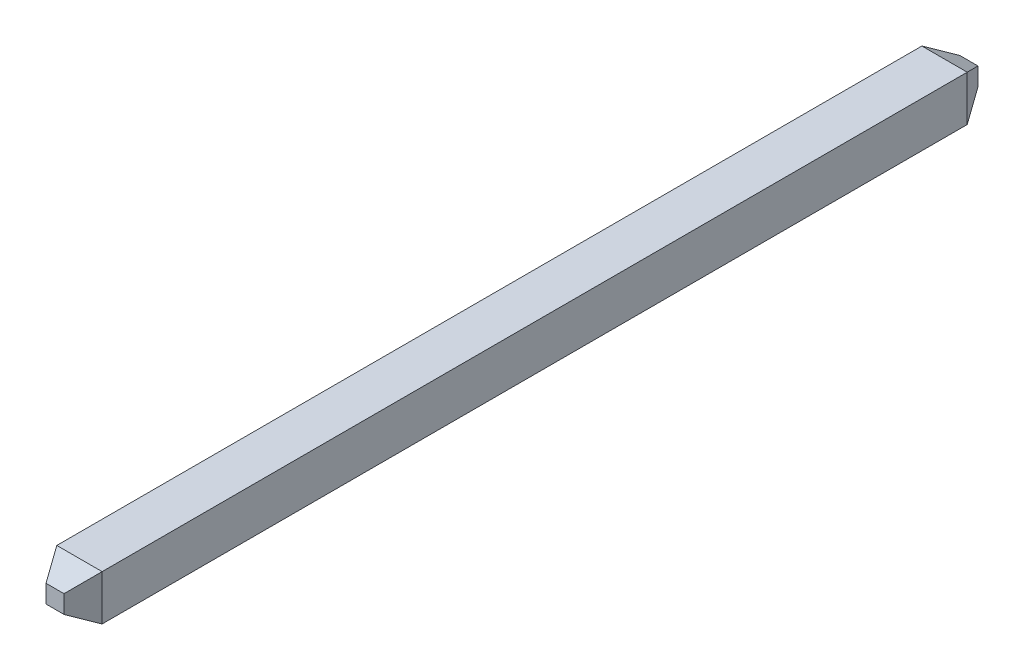
ISO-10303-21;
HEADER;
FILE_DESCRIPTION(('STEP AP214'),'2;1');
FILE_NAME('part.step','',(''),(''),'','','');
FILE_SCHEMA(('AUTOMOTIVE_DESIGN { 1 0 10303 214 1 1 1 1 }'));
ENDSEC;
DATA;
#1=APPLICATION_CONTEXT('core data for automotive mechanical design processes');
#2=APPLICATION_PROTOCOL_DEFINITION('international standard','automotive_design',2000,#1);
#3=PRODUCT_CONTEXT('',#1,'mechanical');
#4=PRODUCT('Part','Part','',(#3));
#5=PRODUCT_RELATED_PRODUCT_CATEGORY('part','',(#4));
#6=PRODUCT_DEFINITION_FORMATION('','',#4);
#7=PRODUCT_DEFINITION_CONTEXT('part definition',#1,'design');
#8=PRODUCT_DEFINITION('design','',#6,#7);
#9=PRODUCT_DEFINITION_SHAPE('','',#8);
#10=(LENGTH_UNIT() NAMED_UNIT(*) SI_UNIT(.MILLI.,.METRE.));
#11=(NAMED_UNIT(*) PLANE_ANGLE_UNIT() SI_UNIT($,.RADIAN.));
#12=(NAMED_UNIT(*) SI_UNIT($,.STERADIAN.) SOLID_ANGLE_UNIT());
#13=UNCERTAINTY_MEASURE_WITH_UNIT(LENGTH_MEASURE(1.E-05),#10,'distance_accuracy_value','');
#14=(GEOMETRIC_REPRESENTATION_CONTEXT(3) GLOBAL_UNCERTAINTY_ASSIGNED_CONTEXT((#13)) GLOBAL_UNIT_ASSIGNED_CONTEXT((#10,
#11,#12)) REPRESENTATION_CONTEXT('',''));
#15=CARTESIAN_POINT('',(0.,0.,0.));
#16=DIRECTION('',(0.,0.,1.));
#17=DIRECTION('',(1.,0.,0.));
#18=AXIS2_PLACEMENT_3D('',#15,#16,#17);
#19=CARTESIAN_POINT('',(5.20011510041924,-1.595,-3.20872569516347));
#20=DIRECTION('',(0.872569516347453,0.,-0.488489958076081));
#21=DIRECTION('',(-0.488489958076081,0.,-0.872569516347453));
#22=AXIS2_PLACEMENT_3D('',#19,#20,#21);
#23=PLANE('',#22);
#24=DIRECTION('',(0.,1.,0.));
#25=VECTOR('',#24,1.);
#26=CARTESIAN_POINT('',(5.39534185664468,-1.595,-2.86000017186176));
#27=LINE('',#26,#25);
#28=CARTESIAN_POINT('',(5.39534185663263,-1.58500002468493,-2.85999984563027));
#29=VERTEX_POINT('',#28);
#30=CARTESIAN_POINT('',(5.39534201729187,-0.954999839641339,-2.8599998849043));
#31=VERTEX_POINT('',#30);
#32=EDGE_CURVE('E118',#29,#31,#27,.T.);
#33=ORIENTED_EDGE('',*,*,#32,.F.);
#34=DIRECTION('',(0.43907261756865,-0.438284036988111,0.784297353956278));
#35=VECTOR('',#34,1.);
#36=CARTESIAN_POINT('',(5.205,-1.395,-3.2));
#37=LINE('',#36,#35);
#38=CARTESIAN_POINT('',(5.205,-1.395,-3.2));
#39=VERTEX_POINT('',#38);
#40=EDGE_CURVE('E116',#39,#29,#37,.T.);
#41=ORIENTED_EDGE('',*,*,#40,.F.);
#42=DIRECTION('',(0.,1.,0.));
#43=VECTOR('',#42,1.);
#44=CARTESIAN_POINT('',(5.205,-1.405,-3.2));
#45=LINE('',#44,#43);
#46=CARTESIAN_POINT('',(5.205,-1.145,-3.2));
#47=VERTEX_POINT('',#46);
#48=EDGE_CURVE('E79',#47,#39,#45,.F.);
#49=ORIENTED_EDGE('',*,*,#48,.F.);
#50=DIRECTION('',(-0.439072617568649,-0.43828403698811,-0.784297353956278));
#51=VECTOR('',#50,1.);
#52=CARTESIAN_POINT('',(5.39534185664468,-0.955000000000001,-2.86000017186176));
#53=LINE('',#52,#51);
#54=EDGE_CURVE('E110',#31,#47,#53,.T.);
#55=ORIENTED_EDGE('',*,*,#54,.F.);
#56=EDGE_LOOP('',(#33,#41,#49,#55));
#57=FACE_BOUND('',#56,.T.);
#58=ADVANCED_FACE('F17',(#57),#23,.T.);
#59=CARTESIAN_POINT('',(5.20036702814295,-1.595,9.50441734607014));
#60=DIRECTION('',(0.873317045523297,0.,0.487152273933377));
#61=DIRECTION('',(0.487152273933377,0.,-0.873317045523297));
#62=AXIS2_PLACEMENT_3D('',#59,#60,#61);
#63=PLANE('',#62);
#64=DIRECTION('',(-0.437799852400894,0.438586917260846,0.784839349959839));
#65=VECTOR('',#64,1.);
#66=CARTESIAN_POINT('',(5.39489789955164,-1.58500031317147,9.15568378706484));
#67=LINE('',#66,#65);
#68=CARTESIAN_POINT('',(5.39489765454992,-1.58500010892315,9.15568368845103));
#69=VERTEX_POINT('',#68);
#70=CARTESIAN_POINT('',(5.20523855088228,-1.395,9.49568417561491));
#71=VERTEX_POINT('',#70);
#72=EDGE_CURVE('E122',#69,#71,#67,.T.);
#73=ORIENTED_EDGE('',*,*,#72,.F.);
#74=DIRECTION('',(0.,1.,0.));
#75=VECTOR('',#74,1.);
#76=CARTESIAN_POINT('',(5.39489853900642,-1.595,9.155683722437));
#77=LINE('',#76,#75);
#78=CARTESIAN_POINT('',(5.39489765280461,-0.954999822967399,9.15568371270386));
#79=VERTEX_POINT('',#78);
#80=EDGE_CURVE('E89',#79,#69,#77,.F.);
#81=ORIENTED_EDGE('',*,*,#80,.F.);
#82=DIRECTION('',(0.437799852400902,0.438586917260844,-0.784839349959836));
#83=VECTOR('',#82,1.);
#84=CARTESIAN_POINT('',(5.20523855088228,-1.145,9.49568417561491));
#85=LINE('',#84,#83);
#86=CARTESIAN_POINT('',(5.20523855088228,-1.145,9.49568417561491));
#87=VERTEX_POINT('',#86);
#88=EDGE_CURVE('E84',#87,#79,#85,.T.);
#89=ORIENTED_EDGE('',*,*,#88,.F.);
#90=DIRECTION('',(0.,1.,0.));
#91=VECTOR('',#90,1.);
#92=CARTESIAN_POINT('',(5.20523855088228,-1.135,9.49568417561491));
#93=LINE('',#92,#91);
#94=EDGE_CURVE('E20',#71,#87,#93,.T.);
#95=ORIENTED_EDGE('',*,*,#94,.F.);
#96=EDGE_LOOP('',(#73,#81,#89,#95));
#97=FACE_BOUND('',#96,.T.);
#98=ADVANCED_FACE('F86',(#97),#63,.T.);
#99=CARTESIAN_POINT('',(4.94523855088228,-1.135,9.49568417561491));
#100=DIRECTION('',(0.,0.,1.));
#101=DIRECTION('',(1.,0.,0.));
#102=AXIS2_PLACEMENT_3D('',#99,#100,#101);
#103=PLANE('',#102);
#104=DIRECTION('',(1.,0.,0.));
#105=VECTOR('',#104,1.);
#106=CARTESIAN_POINT('',(4.7548966942376,-1.145,9.49568417561491));
#107=LINE('',#106,#105);
#108=CARTESIAN_POINT('',(4.95523855088228,-1.145,9.49568417561491));
#109=VERTEX_POINT('',#108);
#110=EDGE_CURVE('E93',#109,#87,#107,.T.);
#111=ORIENTED_EDGE('',*,*,#110,.F.);
#112=DIRECTION('',(0.,1.,0.));
#113=VECTOR('',#112,1.);
#114=CARTESIAN_POINT('',(4.95523855088228,-1.595,9.49568417561491));
#115=LINE('',#114,#113);
#116=CARTESIAN_POINT('',(4.95523855088228,-1.395,9.49568417561491));
#117=VERTEX_POINT('',#116);
#118=EDGE_CURVE('E129',#117,#109,#115,.T.);
#119=ORIENTED_EDGE('',*,*,#118,.F.);
#120=DIRECTION('',(1.,0.,0.));
#121=VECTOR('',#120,1.);
#122=CARTESIAN_POINT('',(4.7548966942376,-1.395,9.49568417561491));
#123=LINE('',#122,#121);
#124=EDGE_CURVE('E98',#71,#117,#123,.F.);
#125=ORIENTED_EDGE('',*,*,#124,.F.);
#126=ORIENTED_EDGE('',*,*,#94,.T.);
#127=EDGE_LOOP('',(#111,#119,#125,#126));
#128=FACE_BOUND('',#127,.T.);
#129=ADVANCED_FACE('F95',(#128),#103,.T.);
#130=CARTESIAN_POINT('',(4.7548966942376,-1.14987821545568,9.50441360938624));
#131=DIRECTION('',(0.,0.872943377132664,0.487821545567864));
#132=DIRECTION('',(0.,-0.487821545567864,0.872943377132664));
#133=AXIS2_PLACEMENT_3D('',#130,#131,#132);
#134=PLANE('',#133);
#135=DIRECTION('',(-0.439072459537934,0.438284700441648,-0.784297071672516));
#136=VECTOR('',#135,1.);
#137=CARTESIAN_POINT('',(4.95523855088228,-1.145,9.49568417561491));
#138=LINE('',#137,#136);
#139=CARTESIAN_POINT('',(4.7648975037028,-0.954999917527427,9.15568447138296));
#140=VERTEX_POINT('',#139);
#141=EDGE_CURVE('E102',#109,#140,#138,.T.);
#142=ORIENTED_EDGE('',*,*,#141,.F.);
#143=ORIENTED_EDGE('',*,*,#110,.T.);
#144=ORIENTED_EDGE('',*,*,#88,.T.);
#145=DIRECTION('',(1.,0.,0.));
#146=VECTOR('',#145,1.);
#147=CARTESIAN_POINT('',(5.08006658937282,-0.955,9.15568497320463));
#148=LINE('',#147,#146);
#149=EDGE_CURVE('E131',#140,#79,#148,.T.);
#150=ORIENTED_EDGE('',*,*,#149,.F.);
#151=EDGE_LOOP('',(#142,#143,#144,#150));
#152=FACE_BOUND('',#151,.T.);
#153=ADVANCED_FACE('F100',(#152),#134,.T.);
#154=CARTESIAN_POINT('',(4.945,-1.405,-3.2));
#155=DIRECTION('',(0.,0.,-1.));
#156=DIRECTION('',(-1.,0.,0.));
#157=AXIS2_PLACEMENT_3D('',#154,#155,#156);
#158=PLANE('',#157);
#159=ORIENTED_EDGE('',*,*,#48,.T.);
#160=DIRECTION('',(1.,0.,0.));
#161=VECTOR('',#160,1.);
#162=CARTESIAN_POINT('',(4.75534185664468,-1.395,-3.2));
#163=LINE('',#162,#161);
#164=CARTESIAN_POINT('',(4.955,-1.395,-3.2));
#165=VERTEX_POINT('',#164);
#166=EDGE_CURVE('E113',#165,#39,#163,.T.);
#167=ORIENTED_EDGE('',*,*,#166,.F.);
#168=DIRECTION('',(0.,1.,0.));
#169=VECTOR('',#168,1.);
#170=CARTESIAN_POINT('',(4.955,-1.595,-3.2));
#171=LINE('',#170,#169);
#172=CARTESIAN_POINT('',(4.955,-1.145,-3.2));
#173=VERTEX_POINT('',#172);
#174=EDGE_CURVE('E140',#173,#165,#171,.F.);
#175=ORIENTED_EDGE('',*,*,#174,.F.);
#176=DIRECTION('',(1.,0.,0.));
#177=VECTOR('',#176,1.);
#178=CARTESIAN_POINT('',(4.75534185664468,-1.145,-3.2));
#179=LINE('',#178,#177);
#180=EDGE_CURVE('E105',#47,#173,#179,.F.);
#181=ORIENTED_EDGE('',*,*,#180,.F.);
#182=EDGE_LOOP('',(#159,#167,#175,#181));
#183=FACE_BOUND('',#182,.T.);
#184=ADVANCED_FACE('F184',(#183),#158,.T.);
#185=CARTESIAN_POINT('',(4.75534185664468,-0.950121784544321,-2.85127073809043));
#186=DIRECTION('',(0.,0.872943377132663,-0.487821545567865));
#187=DIRECTION('',(0.,0.487821545567865,0.872943377132663));
#188=AXIS2_PLACEMENT_3D('',#185,#186,#187);
#189=PLANE('',#188);
#190=DIRECTION('',(1.,0.,0.));
#191=VECTOR('',#190,1.);
#192=CARTESIAN_POINT('',(5.08006658937282,-0.955,-2.86000017186176));
#193=LINE('',#192,#191);
#194=CARTESIAN_POINT('',(4.76534144768619,-0.954999293190895,-2.8599984305592));
#195=VERTEX_POINT('',#194);
#196=EDGE_CURVE('E137',#31,#195,#193,.F.);
#197=ORIENTED_EDGE('',*,*,#196,.F.);
#198=ORIENTED_EDGE('',*,*,#54,.T.);
#199=ORIENTED_EDGE('',*,*,#180,.T.);
#200=DIRECTION('',(0.437798396819592,-0.438586429089664,-0.784840434713052));
#201=VECTOR('',#200,1.);
#202=CARTESIAN_POINT('',(4.76534066407532,-0.954999279369218,-2.85999803394471));
#203=LINE('',#202,#201);
#204=EDGE_CURVE('E145',#195,#173,#203,.T.);
#205=ORIENTED_EDGE('',*,*,#204,.F.);
#206=EDGE_LOOP('',(#197,#198,#199,#205));
#207=FACE_BOUND('',#206,.T.);
#208=ADVANCED_FACE('F182',(#207),#189,.T.);
#209=CARTESIAN_POINT('',(4.75534185664468,-1.39012178454432,-3.20872943377133));
#210=DIRECTION('',(0.,-0.872943377132663,-0.487821545567865));
#211=DIRECTION('',(0.,0.487821545567865,-0.872943377132663));
#212=AXIS2_PLACEMENT_3D('',#209,#210,#211);
#213=PLANE('',#212);
#214=ORIENTED_EDGE('',*,*,#166,.T.);
#215=ORIENTED_EDGE('',*,*,#40,.T.);
#216=DIRECTION('',(1.,0.,0.));
#217=VECTOR('',#216,1.);
#218=CARTESIAN_POINT('',(4.75494834685547,-1.585,-2.85999756200982));
#219=LINE('',#218,#217);
#220=CARTESIAN_POINT('',(4.76534198218488,-1.58500027023654,-2.85999898491791));
#221=VERTEX_POINT('',#220);
#222=EDGE_CURVE('E35',#221,#29,#219,.T.);
#223=ORIENTED_EDGE('',*,*,#222,.F.);
#224=DIRECTION('',(-0.437798396819593,-0.438586429089661,0.784840434713054));
#225=VECTOR('',#224,1.);
#226=CARTESIAN_POINT('',(4.955,-1.395,-3.2));
#227=LINE('',#226,#225);
#228=EDGE_CURVE('E143',#165,#221,#227,.T.);
#229=ORIENTED_EDGE('',*,*,#228,.F.);
#230=EDGE_LOOP('',(#214,#215,#223,#229));
#231=FACE_BOUND('',#230,.T.);
#232=ADVANCED_FACE('F185',(#231),#213,.T.);
#233=CARTESIAN_POINT('',(5.39534630826875,-1.595,-2.98065701705514));
#234=DIRECTION('',(0.999999999319383,0.,3.68949151672057E-05));
#235=DIRECTION('',(3.68949151672057E-05,0.,-0.999999999319383));
#236=AXIS2_PLACEMENT_3D('',#233,#234,#235);
#237=PLANE('',#236);
#238=DIRECTION('',(3.69481335098094E-05,0.,-0.999999999317418));
#239=VECTOR('',#238,1.);
#240=CARTESIAN_POINT('',(5.39489789955164,-0.955,9.1556837224134));
#241=LINE('',#240,#239);
#242=EDGE_CURVE('E134',#79,#31,#241,.T.);
#243=ORIENTED_EDGE('',*,*,#242,.F.);
#244=ORIENTED_EDGE('',*,*,#80,.T.);
#245=DIRECTION('',(-3.69481335098094E-05,0.,0.999999999317418));
#246=VECTOR('',#245,1.);
#247=CARTESIAN_POINT('',(5.39534185664468,-1.585,-2.86000017186176));
#248=LINE('',#247,#246);
#249=EDGE_CURVE('E149',#29,#69,#248,.T.);
#250=ORIENTED_EDGE('',*,*,#249,.F.);
#251=ORIENTED_EDGE('',*,*,#32,.T.);
#252=EDGE_LOOP('',(#243,#244,#250,#251));
#253=FACE_BOUND('',#252,.T.);
#254=ADVANCED_FACE('F187',(#253),#237,.T.);
#255=CARTESIAN_POINT('',(4.7548966942376,-1.58987821545568,9.14695491370534));
#256=DIRECTION('',(0.,-0.872943377132664,0.487821545567864));
#257=DIRECTION('',(0.,-0.487821545567864,-0.872943377132664));
#258=AXIS2_PLACEMENT_3D('',#255,#256,#257);
#259=PLANE('',#258);
#260=ORIENTED_EDGE('',*,*,#124,.T.);
#261=DIRECTION('',(0.439072459537933,0.438284700441648,0.784297071672517));
#262=VECTOR('',#261,1.);
#263=CARTESIAN_POINT('',(4.76489724886554,-1.5849998023649,9.15568533818575));
#264=LINE('',#263,#262);
#265=CARTESIAN_POINT('',(4.76489781760237,-1.58499988392429,9.15568487573228));
#266=VERTEX_POINT('',#265);
#267=EDGE_CURVE('E126',#266,#117,#264,.T.);
#268=ORIENTED_EDGE('',*,*,#267,.F.);
#269=DIRECTION('',(1.,0.,0.));
#270=VECTOR('',#269,1.);
#271=CARTESIAN_POINT('',(4.75494834685547,-1.585,9.15568372241339));
#272=LINE('',#271,#270);
#273=EDGE_CURVE('E152',#69,#266,#272,.F.);
#274=ORIENTED_EDGE('',*,*,#273,.F.);
#275=ORIENTED_EDGE('',*,*,#72,.T.);
#276=EDGE_LOOP('',(#260,#268,#274,#275));
#277=FACE_BOUND('',#276,.T.);
#278=ADVANCED_FACE('F174',(#277),#259,.T.);
#279=CARTESIAN_POINT('',(4.96012345046304,-1.595,9.50440987077839));
#280=DIRECTION('',(-0.872569516347453,0.,0.488489958076081));
#281=DIRECTION('',(0.488489958076081,0.,0.872569516347453));
#282=AXIS2_PLACEMENT_3D('',#279,#280,#281);
#283=PLANE('',#282);
#284=ORIENTED_EDGE('',*,*,#267,.T.);
#285=ORIENTED_EDGE('',*,*,#118,.T.);
#286=ORIENTED_EDGE('',*,*,#141,.T.);
#287=DIRECTION('',(0.,1.,0.));
#288=VECTOR('',#287,1.);
#289=CARTESIAN_POINT('',(4.76489853896028,-1.595,9.15568497322818));
#290=LINE('',#289,#288);
#291=EDGE_CURVE('E155',#266,#140,#290,.T.);
#292=ORIENTED_EDGE('',*,*,#291,.F.);
#293=EDGE_LOOP('',(#284,#285,#286,#292));
#294=FACE_BOUND('',#293,.T.);
#295=ADVANCED_FACE('F177',(#294),#283,.T.);
#296=CARTESIAN_POINT('',(5.08006658937282,-0.955,9.32634470275115));
#297=DIRECTION('',(0.,1.,0.));
#298=DIRECTION('',(0.,0.,1.));
#299=AXIS2_PLACEMENT_3D('',#296,#297,#298);
#300=PLANE('',#299);
#301=ORIENTED_EDGE('',*,*,#196,.T.);
#302=DIRECTION('',(-3.68949151674615E-05,0.,0.999999999319383));
#303=VECTOR('',#302,1.);
#304=CARTESIAN_POINT('',(4.76489224235438,-0.955000197635096,9.32634821671993));
#305=LINE('',#304,#303);
#306=EDGE_CURVE('E158',#140,#195,#305,.F.);
#307=ORIENTED_EDGE('',*,*,#306,.F.);
#308=ORIENTED_EDGE('',*,*,#149,.T.);
#309=ORIENTED_EDGE('',*,*,#242,.T.);
#310=EDGE_LOOP('',(#301,#307,#308,#309));
#311=FACE_BOUND('',#310,.T.);
#312=ADVANCED_FACE('F179',(#311),#300,.T.);
#313=CARTESIAN_POINT('',(4.95987152273933,-1.595,-3.20873317045523));
#314=DIRECTION('',(-0.873317045523297,0.,-0.487152273933377));
#315=DIRECTION('',(-0.487152273933377,0.,0.873317045523297));
#316=AXIS2_PLACEMENT_3D('',#313,#314,#315);
#317=PLANE('',#316);
#318=DIRECTION('',(0.,1.,0.));
#319=VECTOR('',#318,1.);
#320=CARTESIAN_POINT('',(4.76534185654839,-1.595,-2.85999756199704));
#321=LINE('',#320,#319);
#322=EDGE_CURVE('E26',#195,#221,#321,.F.);
#323=ORIENTED_EDGE('',*,*,#322,.F.);
#324=ORIENTED_EDGE('',*,*,#204,.T.);
#325=ORIENTED_EDGE('',*,*,#174,.T.);
#326=ORIENTED_EDGE('',*,*,#228,.T.);
#327=EDGE_LOOP('',(#323,#324,#325,#326));
#328=FACE_BOUND('',#327,.T.);
#329=ADVANCED_FACE('F168',(#328),#317,.T.);
#330=CARTESIAN_POINT('',(4.75494834685547,-1.585,3.17284922525592));
#331=DIRECTION('',(0.,-1.,0.));
#332=DIRECTION('',(0.,0.,-1.));
#333=AXIS2_PLACEMENT_3D('',#330,#331,#332);
#334=PLANE('',#333);
#335=ORIENTED_EDGE('',*,*,#249,.T.);
#336=ORIENTED_EDGE('',*,*,#273,.T.);
#337=DIRECTION('',(-3.68949151674615E-05,0.,0.999999999319383));
#338=VECTOR('',#337,1.);
#339=CARTESIAN_POINT('',(4.76489224235438,-1.58500072063078,9.32634821671993));
#340=LINE('',#339,#338);
#341=EDGE_CURVE('E11',#221,#266,#340,.T.);
#342=ORIENTED_EDGE('',*,*,#341,.F.);
#343=ORIENTED_EDGE('',*,*,#222,.T.);
#344=EDGE_LOOP('',(#335,#336,#342,#343));
#345=FACE_BOUND('',#344,.T.);
#346=ADVANCED_FACE('F170',(#345),#334,.T.);
#347=CARTESIAN_POINT('',(4.76489224235438,-1.595,9.32634821671993));
#348=DIRECTION('',(-0.999999999319383,0.,-3.68949151674615E-05));
#349=DIRECTION('',(-3.68949151674615E-05,0.,0.999999999319383));
#350=AXIS2_PLACEMENT_3D('',#347,#348,#349);
#351=PLANE('',#350);
#352=ORIENTED_EDGE('',*,*,#322,.T.);
#353=ORIENTED_EDGE('',*,*,#341,.T.);
#354=ORIENTED_EDGE('',*,*,#291,.T.);
#355=ORIENTED_EDGE('',*,*,#306,.T.);
#356=EDGE_LOOP('',(#352,#353,#354,#355));
#357=FACE_BOUND('',#356,.T.);
#358=ADVANCED_FACE('F164',(#357),#351,.T.);
#359=CLOSED_SHELL('',(#58,#98,#129,#153,#184,#208,#232,#254,#278,#295,#312,#329,#346,#358));
#360=MANIFOLD_SOLID_BREP('B1',#359);
#361=ADVANCED_BREP_SHAPE_REPRESENTATION('',(#18,#360),#14);
#362=SHAPE_DEFINITION_REPRESENTATION(#9,#361);
ENDSEC;
END-ISO-10303-21;
